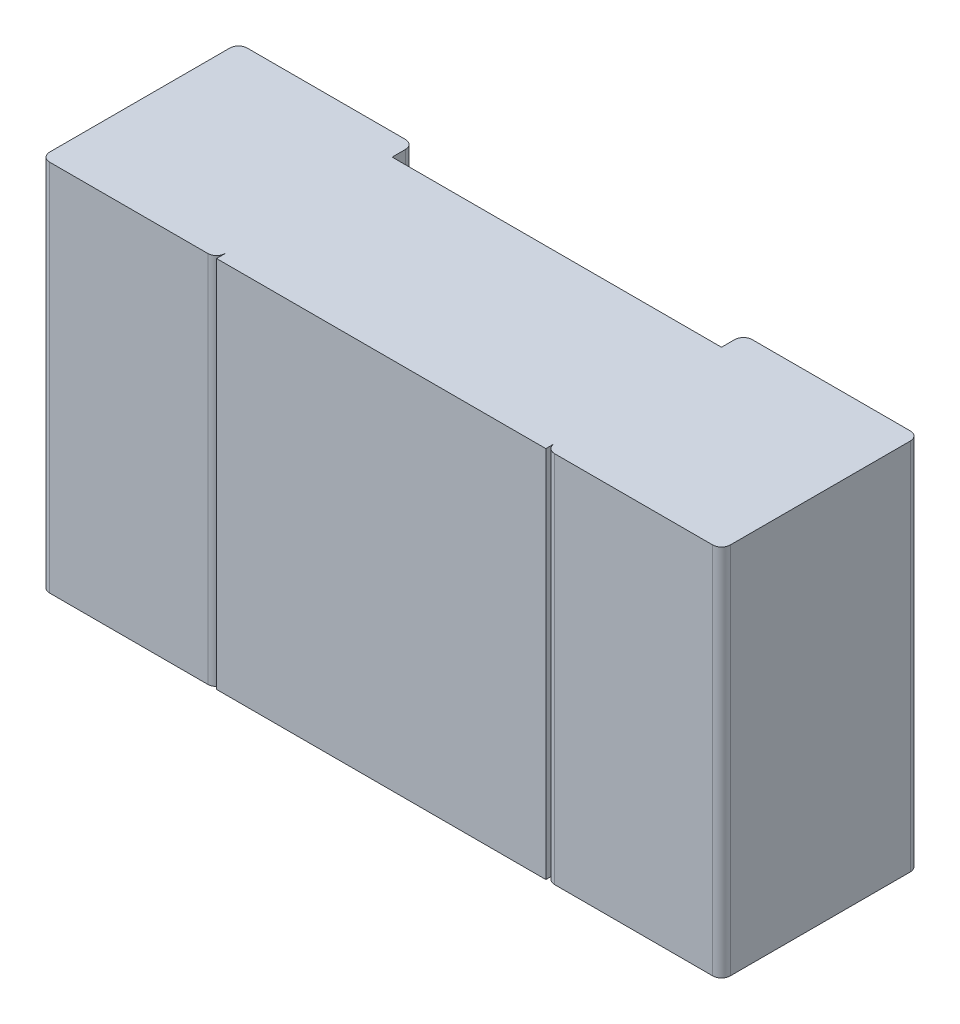
ISO-10303-21;
HEADER;
FILE_DESCRIPTION(('STEP AP214'),'2;1');
FILE_NAME('part.step','',(''),(''),'','','');
FILE_SCHEMA(('AUTOMOTIVE_DESIGN { 1 0 10303 214 1 1 1 1 }'));
ENDSEC;
DATA;
#1=APPLICATION_CONTEXT('core data for automotive mechanical design processes');
#2=APPLICATION_PROTOCOL_DEFINITION('international standard','automotive_design',2000,#1);
#3=PRODUCT_CONTEXT('',#1,'mechanical');
#4=PRODUCT('Part','Part','',(#3));
#5=PRODUCT_RELATED_PRODUCT_CATEGORY('part','',(#4));
#6=PRODUCT_DEFINITION_FORMATION('','',#4);
#7=PRODUCT_DEFINITION_CONTEXT('part definition',#1,'design');
#8=PRODUCT_DEFINITION('design','',#6,#7);
#9=PRODUCT_DEFINITION_SHAPE('','',#8);
#10=(LENGTH_UNIT() NAMED_UNIT(*) SI_UNIT(.MILLI.,.METRE.));
#11=(NAMED_UNIT(*) PLANE_ANGLE_UNIT() SI_UNIT($,.RADIAN.));
#12=(NAMED_UNIT(*) SI_UNIT($,.STERADIAN.) SOLID_ANGLE_UNIT());
#13=UNCERTAINTY_MEASURE_WITH_UNIT(LENGTH_MEASURE(1.E-05),#10,'distance_accuracy_value','');
#14=(GEOMETRIC_REPRESENTATION_CONTEXT(3) GLOBAL_UNCERTAINTY_ASSIGNED_CONTEXT((#13)) GLOBAL_UNIT_ASSIGNED_CONTEXT((#10,
#11,#12)) REPRESENTATION_CONTEXT('',''));
#15=CARTESIAN_POINT('',(0.,0.,0.));
#16=DIRECTION('',(0.,0.,1.));
#17=DIRECTION('',(1.,0.,0.));
#18=AXIS2_PLACEMENT_3D('',#15,#16,#17);
#19=CARTESIAN_POINT('',(-0.775,-0.425,0.));
#20=DIRECTION('',(0.,0.,1.));
#21=DIRECTION('',(1.,0.,0.));
#22=AXIS2_PLACEMENT_3D('',#19,#20,#21);
#23=PLANE('',#22);
#24=DIRECTION('',(1.,0.,0.));
#25=VECTOR('',#24,1.);
#26=CARTESIAN_POINT('',(-0.775,-0.425,0.));
#27=LINE('',#26,#25);
#28=CARTESIAN_POINT('',(-0.395,-0.425,0.));
#29=VERTEX_POINT('',#28);
#30=CARTESIAN_POINT('',(-0.755,-0.425,0.));
#31=VERTEX_POINT('',#30);
#32=EDGE_CURVE('E176',#29,#31,#27,.F.);
#33=ORIENTED_EDGE('',*,*,#32,.T.);
#34=DIRECTION('',(0.,1.,0.));
#35=VECTOR('',#34,1.);
#36=CARTESIAN_POINT('',(-0.755,-0.425,0.));
#37=LINE('',#36,#35);
#38=CARTESIAN_POINT('',(-0.755,0.425,0.));
#39=VERTEX_POINT('',#38);
#40=EDGE_CURVE('E151',#39,#31,#37,.F.);
#41=ORIENTED_EDGE('',*,*,#40,.F.);
#42=DIRECTION('',(1.,0.,0.));
#43=VECTOR('',#42,1.);
#44=CARTESIAN_POINT('',(-0.775,0.425,0.));
#45=LINE('',#44,#43);
#46=CARTESIAN_POINT('',(-0.395,0.425,0.));
#47=VERTEX_POINT('',#46);
#48=EDGE_CURVE('E286',#47,#39,#45,.F.);
#49=ORIENTED_EDGE('',*,*,#48,.F.);
#50=DIRECTION('',(0.,1.,0.));
#51=VECTOR('',#50,1.);
#52=CARTESIAN_POINT('',(-0.395,-0.425,0.));
#53=LINE('',#52,#51);
#54=EDGE_CURVE('E177',#29,#47,#53,.T.);
#55=ORIENTED_EDGE('',*,*,#54,.F.);
#56=EDGE_LOOP('',(#33,#41,#49,#55));
#57=FACE_BOUND('',#56,.T.);
#58=ADVANCED_FACE('F17',(#57),#23,.F.);
#59=CARTESIAN_POINT('',(-0.755,-0.425,0.02));
#60=DIRECTION('',(0.,1.,0.));
#61=DIRECTION('',(0.,0.,1.));
#62=AXIS2_PLACEMENT_3D('',#59,#60,#61);
#63=CYLINDRICAL_SURFACE('',#62,0.02);
#64=ORIENTED_EDGE('',*,*,#40,.T.);
#65=CARTESIAN_POINT('',(-0.755,-0.425,0.02));
#66=DIRECTION('',(0.,1.,0.));
#67=DIRECTION('',(0.,0.,1.));
#68=AXIS2_PLACEMENT_3D('',#65,#66,#67);
#69=CIRCLE('',#68,0.02);
#70=CARTESIAN_POINT('',(-0.775,-0.425,0.02));
#71=VERTEX_POINT('',#70);
#72=EDGE_CURVE('E20',#31,#71,#69,.T.);
#73=ORIENTED_EDGE('',*,*,#72,.T.);
#74=DIRECTION('',(0.,1.,0.));
#75=VECTOR('',#74,1.);
#76=CARTESIAN_POINT('',(-0.775,-0.425,0.02));
#77=LINE('',#76,#75);
#78=CARTESIAN_POINT('',(-0.775,0.425,0.02));
#79=VERTEX_POINT('',#78);
#80=EDGE_CURVE('E158',#71,#79,#77,.T.);
#81=ORIENTED_EDGE('',*,*,#80,.T.);
#82=CARTESIAN_POINT('',(-0.755,0.425,0.02));
#83=DIRECTION('',(0.,1.,0.));
#84=DIRECTION('',(0.,0.,1.));
#85=AXIS2_PLACEMENT_3D('',#82,#83,#84);
#86=CIRCLE('',#85,0.02);
#87=EDGE_CURVE('E284',#39,#79,#86,.T.);
#88=ORIENTED_EDGE('',*,*,#87,.F.);
#89=EDGE_LOOP('',(#64,#73,#81,#88));
#90=FACE_BOUND('',#89,.T.);
#91=ADVANCED_FACE('F175',(#90),#63,.T.);
#92=CARTESIAN_POINT('',(-0.775,-0.425,0.));
#93=DIRECTION('',(1.,0.,0.));
#94=DIRECTION('',(0.,0.,-1.));
#95=AXIS2_PLACEMENT_3D('',#92,#93,#94);
#96=PLANE('',#95);
#97=DIRECTION('',(0.,0.,1.));
#98=VECTOR('',#97,1.);
#99=CARTESIAN_POINT('',(-0.775,0.425,0.));
#100=LINE('',#99,#98);
#101=CARTESIAN_POINT('',(-0.775,0.425,0.43));
#102=VERTEX_POINT('',#101);
#103=EDGE_CURVE('E163',#79,#102,#100,.T.);
#104=ORIENTED_EDGE('',*,*,#103,.F.);
#105=ORIENTED_EDGE('',*,*,#80,.F.);
#106=DIRECTION('',(0.,0.,1.));
#107=VECTOR('',#106,1.);
#108=CARTESIAN_POINT('',(-0.775,-0.425,0.));
#109=LINE('',#108,#107);
#110=CARTESIAN_POINT('',(-0.775,-0.425,0.43));
#111=VERTEX_POINT('',#110);
#112=EDGE_CURVE('E162',#71,#111,#109,.T.);
#113=ORIENTED_EDGE('',*,*,#112,.T.);
#114=DIRECTION('',(0.,1.,0.));
#115=VECTOR('',#114,1.);
#116=CARTESIAN_POINT('',(-0.775,-0.425,0.43));
#117=LINE('',#116,#115);
#118=EDGE_CURVE('E164',#102,#111,#117,.F.);
#119=ORIENTED_EDGE('',*,*,#118,.F.);
#120=EDGE_LOOP('',(#104,#105,#113,#119));
#121=FACE_BOUND('',#120,.T.);
#122=ADVANCED_FACE('F160',(#121),#96,.F.);
#123=CARTESIAN_POINT('',(-0.755,-0.425,0.43));
#124=DIRECTION('',(0.,1.,0.));
#125=DIRECTION('',(0.,0.,1.));
#126=AXIS2_PLACEMENT_3D('',#123,#124,#125);
#127=CYLINDRICAL_SURFACE('',#126,0.02);
#128=CARTESIAN_POINT('',(-0.755,0.425,0.43));
#129=DIRECTION('',(0.,1.,0.));
#130=DIRECTION('',(0.,0.,1.));
#131=AXIS2_PLACEMENT_3D('',#128,#129,#130);
#132=CIRCLE('',#131,0.02);
#133=CARTESIAN_POINT('',(-0.755,0.425,0.45));
#134=VERTEX_POINT('',#133);
#135=EDGE_CURVE('E282',#102,#134,#132,.T.);
#136=ORIENTED_EDGE('',*,*,#135,.F.);
#137=ORIENTED_EDGE('',*,*,#118,.T.);
#138=CARTESIAN_POINT('',(-0.755,-0.425,0.43));
#139=DIRECTION('',(0.,1.,0.));
#140=DIRECTION('',(0.,0.,1.));
#141=AXIS2_PLACEMENT_3D('',#138,#139,#140);
#142=CIRCLE('',#141,0.02);
#143=CARTESIAN_POINT('',(-0.755,-0.425,0.45));
#144=VERTEX_POINT('',#143);
#145=EDGE_CURVE('E173',#111,#144,#142,.T.);
#146=ORIENTED_EDGE('',*,*,#145,.T.);
#147=DIRECTION('',(0.,1.,0.));
#148=VECTOR('',#147,1.);
#149=CARTESIAN_POINT('',(-0.755,-0.425,0.45));
#150=LINE('',#149,#148);
#151=EDGE_CURVE('E246',#134,#144,#150,.F.);
#152=ORIENTED_EDGE('',*,*,#151,.F.);
#153=EDGE_LOOP('',(#136,#137,#146,#152));
#154=FACE_BOUND('',#153,.T.);
#155=ADVANCED_FACE('F378',(#154),#127,.T.);
#156=CARTESIAN_POINT('',(-0.775,-0.425,0.45));
#157=DIRECTION('',(0.,0.,1.));
#158=DIRECTION('',(1.,0.,0.));
#159=AXIS2_PLACEMENT_3D('',#156,#157,#158);
#160=PLANE('',#159);
#161=DIRECTION('',(1.,0.,0.));
#162=VECTOR('',#161,1.);
#163=CARTESIAN_POINT('',(-0.775,-0.425,0.45));
#164=LINE('',#163,#162);
#165=CARTESIAN_POINT('',(-0.395,-0.425,0.45));
#166=VERTEX_POINT('',#165);
#167=EDGE_CURVE('E302',#144,#166,#164,.T.);
#168=ORIENTED_EDGE('',*,*,#167,.T.);
#169=DIRECTION('',(0.,1.,0.));
#170=VECTOR('',#169,1.);
#171=CARTESIAN_POINT('',(-0.395,-0.425,0.45));
#172=LINE('',#171,#170);
#173=CARTESIAN_POINT('',(-0.395,0.425,0.45));
#174=VERTEX_POINT('',#173);
#175=EDGE_CURVE('E243',#174,#166,#172,.F.);
#176=ORIENTED_EDGE('',*,*,#175,.F.);
#177=DIRECTION('',(1.,0.,0.));
#178=VECTOR('',#177,1.);
#179=CARTESIAN_POINT('',(-0.775,0.425,0.45));
#180=LINE('',#179,#178);
#181=EDGE_CURVE('E281',#134,#174,#180,.T.);
#182=ORIENTED_EDGE('',*,*,#181,.F.);
#183=ORIENTED_EDGE('',*,*,#151,.T.);
#184=EDGE_LOOP('',(#168,#176,#182,#183));
#185=FACE_BOUND('',#184,.T.);
#186=ADVANCED_FACE('F380',(#185),#160,.T.);
#187=CARTESIAN_POINT('',(-0.395,-0.425,0.43));
#188=DIRECTION('',(0.,1.,0.));
#189=DIRECTION('',(0.,0.,1.));
#190=AXIS2_PLACEMENT_3D('',#187,#188,#189);
#191=CYLINDRICAL_SURFACE('',#190,0.02);
#192=ORIENTED_EDGE('',*,*,#175,.T.);
#193=CARTESIAN_POINT('',(-0.395,-0.425,0.43));
#194=DIRECTION('',(0.,1.,0.));
#195=DIRECTION('',(0.,0.,1.));
#196=AXIS2_PLACEMENT_3D('',#193,#194,#195);
#197=CIRCLE('',#196,0.02);
#198=CARTESIAN_POINT('',(-0.375,-0.425,0.43));
#199=VERTEX_POINT('',#198);
#200=EDGE_CURVE('E300',#166,#199,#197,.T.);
#201=ORIENTED_EDGE('',*,*,#200,.T.);
#202=DIRECTION('',(0.,1.,0.));
#203=VECTOR('',#202,1.);
#204=CARTESIAN_POINT('',(-0.375,-0.425,0.43));
#205=LINE('',#204,#203);
#206=CARTESIAN_POINT('',(-0.375,0.425,0.43));
#207=VERTEX_POINT('',#206);
#208=EDGE_CURVE('E235',#199,#207,#205,.T.);
#209=ORIENTED_EDGE('',*,*,#208,.T.);
#210=CARTESIAN_POINT('',(-0.395,0.425,0.43));
#211=DIRECTION('',(0.,1.,0.));
#212=DIRECTION('',(0.,0.,1.));
#213=AXIS2_PLACEMENT_3D('',#210,#211,#212);
#214=CIRCLE('',#213,0.02);
#215=EDGE_CURVE('E279',#174,#207,#214,.T.);
#216=ORIENTED_EDGE('',*,*,#215,.F.);
#217=EDGE_LOOP('',(#192,#201,#209,#216));
#218=FACE_BOUND('',#217,.T.);
#219=ADVANCED_FACE('F385',(#218),#191,.T.);
#220=CARTESIAN_POINT('',(-0.375,-0.425,0.4));
#221=DIRECTION('',(1.,0.,0.));
#222=DIRECTION('',(0.,0.,-1.));
#223=AXIS2_PLACEMENT_3D('',#220,#221,#222);
#224=PLANE('',#223);
#225=DIRECTION('',(0.,0.,1.));
#226=VECTOR('',#225,1.);
#227=CARTESIAN_POINT('',(-0.375,0.425,0.4));
#228=LINE('',#227,#226);
#229=CARTESIAN_POINT('',(-0.375,0.425,0.45));
#230=VERTEX_POINT('',#229);
#231=EDGE_CURVE('E231',#207,#230,#228,.T.);
#232=ORIENTED_EDGE('',*,*,#231,.F.);
#233=ORIENTED_EDGE('',*,*,#208,.F.);
#234=DIRECTION('',(0.,0.,1.));
#235=VECTOR('',#234,1.);
#236=CARTESIAN_POINT('',(-0.375,-0.425,0.4));
#237=LINE('',#236,#235);
#238=CARTESIAN_POINT('',(-0.375,-0.425,0.45));
#239=VERTEX_POINT('',#238);
#240=EDGE_CURVE('E259',#199,#239,#237,.T.);
#241=ORIENTED_EDGE('',*,*,#240,.T.);
#242=DIRECTION('',(0.,1.,0.));
#243=VECTOR('',#242,1.);
#244=CARTESIAN_POINT('',(-0.375,-0.425,0.45));
#245=LINE('',#244,#243);
#246=EDGE_CURVE('E227',#230,#239,#245,.F.);
#247=ORIENTED_EDGE('',*,*,#246,.F.);
#248=EDGE_LOOP('',(#232,#233,#241,#247));
#249=FACE_BOUND('',#248,.T.);
#250=ADVANCED_FACE('F388',(#249),#224,.F.);
#251=CARTESIAN_POINT('',(-0.375,-0.425,0.45));
#252=DIRECTION('',(0.,0.,1.));
#253=DIRECTION('',(1.,0.,0.));
#254=AXIS2_PLACEMENT_3D('',#251,#252,#253);
#255=PLANE('',#254);
#256=DIRECTION('',(0.,1.,0.));
#257=VECTOR('',#256,1.);
#258=CARTESIAN_POINT('',(0.375,-0.425,0.45));
#259=LINE('',#258,#257);
#260=CARTESIAN_POINT('',(0.375,0.425,0.45));
#261=VERTEX_POINT('',#260);
#262=CARTESIAN_POINT('',(0.375,-0.425,0.45));
#263=VERTEX_POINT('',#262);
#264=EDGE_CURVE('E215',#261,#263,#259,.F.);
#265=ORIENTED_EDGE('',*,*,#264,.F.);
#266=DIRECTION('',(1.,0.,0.));
#267=VECTOR('',#266,1.);
#268=CARTESIAN_POINT('',(-0.375,0.425,0.45));
#269=LINE('',#268,#267);
#270=EDGE_CURVE('E219',#230,#261,#269,.T.);
#271=ORIENTED_EDGE('',*,*,#270,.F.);
#272=ORIENTED_EDGE('',*,*,#246,.T.);
#273=DIRECTION('',(1.,0.,0.));
#274=VECTOR('',#273,1.);
#275=CARTESIAN_POINT('',(-0.375,-0.425,0.45));
#276=LINE('',#275,#274);
#277=EDGE_CURVE('E254',#239,#263,#276,.T.);
#278=ORIENTED_EDGE('',*,*,#277,.T.);
#279=EDGE_LOOP('',(#265,#271,#272,#278));
#280=FACE_BOUND('',#279,.T.);
#281=ADVANCED_FACE('F393',(#280),#255,.T.);
#282=CARTESIAN_POINT('',(0.375,-0.425,0.4));
#283=DIRECTION('',(1.,0.,0.));
#284=DIRECTION('',(0.,0.,-1.));
#285=AXIS2_PLACEMENT_3D('',#282,#283,#284);
#286=PLANE('',#285);
#287=DIRECTION('',(0.,0.,1.));
#288=VECTOR('',#287,1.);
#289=CARTESIAN_POINT('',(0.375,0.425,0.4));
#290=LINE('',#289,#288);
#291=CARTESIAN_POINT('',(0.375,0.425,0.43));
#292=VERTEX_POINT('',#291);
#293=EDGE_CURVE('E216',#261,#292,#290,.F.);
#294=ORIENTED_EDGE('',*,*,#293,.F.);
#295=ORIENTED_EDGE('',*,*,#264,.T.);
#296=DIRECTION('',(0.,0.,1.));
#297=VECTOR('',#296,1.);
#298=CARTESIAN_POINT('',(0.375,-0.425,0.4));
#299=LINE('',#298,#297);
#300=CARTESIAN_POINT('',(0.375,-0.425,0.43));
#301=VERTEX_POINT('',#300);
#302=EDGE_CURVE('E250',#263,#301,#299,.F.);
#303=ORIENTED_EDGE('',*,*,#302,.T.);
#304=DIRECTION('',(0.,1.,0.));
#305=VECTOR('',#304,1.);
#306=CARTESIAN_POINT('',(0.375,-0.425,0.43));
#307=LINE('',#306,#305);
#308=EDGE_CURVE('E213',#292,#301,#307,.F.);
#309=ORIENTED_EDGE('',*,*,#308,.F.);
#310=EDGE_LOOP('',(#294,#295,#303,#309));
#311=FACE_BOUND('',#310,.T.);
#312=ADVANCED_FACE('F399',(#311),#286,.T.);
#313=CARTESIAN_POINT('',(0.375,-0.425,0.));
#314=DIRECTION('',(0.,0.,1.));
#315=DIRECTION('',(1.,0.,0.));
#316=AXIS2_PLACEMENT_3D('',#313,#314,#315);
#317=PLANE('',#316);
#318=DIRECTION('',(1.,0.,0.));
#319=VECTOR('',#318,1.);
#320=CARTESIAN_POINT('',(0.375,-0.425,0.));
#321=LINE('',#320,#319);
#322=CARTESIAN_POINT('',(0.755,-0.425,0.));
#323=VERTEX_POINT('',#322);
#324=CARTESIAN_POINT('',(0.395,-0.425,0.));
#325=VERTEX_POINT('',#324);
#326=EDGE_CURVE('E253',#323,#325,#321,.F.);
#327=ORIENTED_EDGE('',*,*,#326,.T.);
#328=DIRECTION('',(0.,1.,0.));
#329=VECTOR('',#328,1.);
#330=CARTESIAN_POINT('',(0.395,-0.425,0.));
#331=LINE('',#330,#329);
#332=CARTESIAN_POINT('',(0.395,0.425,0.));
#333=VERTEX_POINT('',#332);
#334=EDGE_CURVE('E222',#333,#325,#331,.F.);
#335=ORIENTED_EDGE('',*,*,#334,.F.);
#336=DIRECTION('',(1.,0.,0.));
#337=VECTOR('',#336,1.);
#338=CARTESIAN_POINT('',(0.375,0.425,0.));
#339=LINE('',#338,#337);
#340=CARTESIAN_POINT('',(0.755,0.425,0.));
#341=VERTEX_POINT('',#340);
#342=EDGE_CURVE('E218',#341,#333,#339,.F.);
#343=ORIENTED_EDGE('',*,*,#342,.F.);
#344=DIRECTION('',(0.,1.,0.));
#345=VECTOR('',#344,1.);
#346=CARTESIAN_POINT('',(0.755,-0.425,0.));
#347=LINE('',#346,#345);
#348=EDGE_CURVE('E204',#323,#341,#347,.T.);
#349=ORIENTED_EDGE('',*,*,#348,.F.);
#350=EDGE_LOOP('',(#327,#335,#343,#349));
#351=FACE_BOUND('',#350,.T.);
#352=ADVANCED_FACE('F355',(#351),#317,.F.);
#353=CARTESIAN_POINT('',(0.395,-0.425,0.43));
#354=DIRECTION('',(0.,1.,0.));
#355=DIRECTION('',(0.,0.,1.));
#356=AXIS2_PLACEMENT_3D('',#353,#354,#355);
#357=CYLINDRICAL_SURFACE('',#356,0.02);
#358=CARTESIAN_POINT('',(0.395,0.425,0.43));
#359=DIRECTION('',(0.,1.,0.));
#360=DIRECTION('',(0.,0.,1.));
#361=AXIS2_PLACEMENT_3D('',#358,#359,#360);
#362=CIRCLE('',#361,0.02);
#363=CARTESIAN_POINT('',(0.395,0.425,0.45));
#364=VERTEX_POINT('',#363);
#365=EDGE_CURVE('E273',#292,#364,#362,.T.);
#366=ORIENTED_EDGE('',*,*,#365,.F.);
#367=ORIENTED_EDGE('',*,*,#308,.T.);
#368=CARTESIAN_POINT('',(0.395,-0.425,0.43));
#369=DIRECTION('',(0.,1.,0.));
#370=DIRECTION('',(0.,0.,1.));
#371=AXIS2_PLACEMENT_3D('',#368,#369,#370);
#372=CIRCLE('',#371,0.02);
#373=CARTESIAN_POINT('',(0.395,-0.425,0.45));
#374=VERTEX_POINT('',#373);
#375=EDGE_CURVE('E295',#301,#374,#372,.T.);
#376=ORIENTED_EDGE('',*,*,#375,.T.);
#377=DIRECTION('',(0.,1.,0.));
#378=VECTOR('',#377,1.);
#379=CARTESIAN_POINT('',(0.395,-0.425,0.45));
#380=LINE('',#379,#378);
#381=EDGE_CURVE('E211',#364,#374,#380,.F.);
#382=ORIENTED_EDGE('',*,*,#381,.F.);
#383=EDGE_LOOP('',(#366,#367,#376,#382));
#384=FACE_BOUND('',#383,.T.);
#385=ADVANCED_FACE('F403',(#384),#357,.T.);
#386=CARTESIAN_POINT('',(0.375,-0.425,0.45));
#387=DIRECTION('',(0.,0.,1.));
#388=DIRECTION('',(1.,0.,0.));
#389=AXIS2_PLACEMENT_3D('',#386,#387,#388);
#390=PLANE('',#389);
#391=DIRECTION('',(1.,0.,0.));
#392=VECTOR('',#391,1.);
#393=CARTESIAN_POINT('',(0.375,-0.425,0.45));
#394=LINE('',#393,#392);
#395=CARTESIAN_POINT('',(0.755,-0.425,0.45));
#396=VERTEX_POINT('',#395);
#397=EDGE_CURVE('E294',#374,#396,#394,.T.);
#398=ORIENTED_EDGE('',*,*,#397,.T.);
#399=DIRECTION('',(0.,1.,0.));
#400=VECTOR('',#399,1.);
#401=CARTESIAN_POINT('',(0.755,-0.425,0.45));
#402=LINE('',#401,#400);
#403=CARTESIAN_POINT('',(0.755,0.425,0.45));
#404=VERTEX_POINT('',#403);
#405=EDGE_CURVE('E209',#404,#396,#402,.F.);
#406=ORIENTED_EDGE('',*,*,#405,.F.);
#407=DIRECTION('',(1.,0.,0.));
#408=VECTOR('',#407,1.);
#409=CARTESIAN_POINT('',(0.375,0.425,0.45));
#410=LINE('',#409,#408);
#411=EDGE_CURVE('E272',#364,#404,#410,.T.);
#412=ORIENTED_EDGE('',*,*,#411,.F.);
#413=ORIENTED_EDGE('',*,*,#381,.T.);
#414=EDGE_LOOP('',(#398,#406,#412,#413));
#415=FACE_BOUND('',#414,.T.);
#416=ADVANCED_FACE('F408',(#415),#390,.T.);
#417=CARTESIAN_POINT('',(0.755,-0.425,0.43));
#418=DIRECTION('',(0.,1.,0.));
#419=DIRECTION('',(0.,0.,1.));
#420=AXIS2_PLACEMENT_3D('',#417,#418,#419);
#421=CYLINDRICAL_SURFACE('',#420,0.02);
#422=ORIENTED_EDGE('',*,*,#405,.T.);
#423=CARTESIAN_POINT('',(0.755,-0.425,0.43));
#424=DIRECTION('',(0.,1.,0.));
#425=DIRECTION('',(0.,0.,1.));
#426=AXIS2_PLACEMENT_3D('',#423,#424,#425);
#427=CIRCLE('',#426,0.02);
#428=CARTESIAN_POINT('',(0.775,-0.425,0.43));
#429=VERTEX_POINT('',#428);
#430=EDGE_CURVE('E291',#396,#429,#427,.T.);
#431=ORIENTED_EDGE('',*,*,#430,.T.);
#432=DIRECTION('',(0.,1.,0.));
#433=VECTOR('',#432,1.);
#434=CARTESIAN_POINT('',(0.775,-0.425,0.43));
#435=LINE('',#434,#433);
#436=CARTESIAN_POINT('',(0.775,0.425,0.43));
#437=VERTEX_POINT('',#436);
#438=EDGE_CURVE('E206',#437,#429,#435,.F.);
#439=ORIENTED_EDGE('',*,*,#438,.F.);
#440=CARTESIAN_POINT('',(0.755,0.425,0.43));
#441=DIRECTION('',(0.,1.,0.));
#442=DIRECTION('',(0.,0.,1.));
#443=AXIS2_PLACEMENT_3D('',#440,#441,#442);
#444=CIRCLE('',#443,0.02);
#445=EDGE_CURVE('E270',#404,#437,#444,.T.);
#446=ORIENTED_EDGE('',*,*,#445,.F.);
#447=EDGE_LOOP('',(#422,#431,#439,#446));
#448=FACE_BOUND('',#447,.T.);
#449=ADVANCED_FACE('F411',(#448),#421,.T.);
#450=CARTESIAN_POINT('',(0.775,-0.425,0.));
#451=DIRECTION('',(1.,0.,0.));
#452=DIRECTION('',(0.,0.,-1.));
#453=AXIS2_PLACEMENT_3D('',#450,#451,#452);
#454=PLANE('',#453);
#455=DIRECTION('',(0.,0.,1.));
#456=VECTOR('',#455,1.);
#457=CARTESIAN_POINT('',(0.775,0.425,0.));
#458=LINE('',#457,#456);
#459=CARTESIAN_POINT('',(0.775,0.425,0.02));
#460=VERTEX_POINT('',#459);
#461=EDGE_CURVE('E269',#437,#460,#458,.F.);
#462=ORIENTED_EDGE('',*,*,#461,.F.);
#463=ORIENTED_EDGE('',*,*,#438,.T.);
#464=DIRECTION('',(0.,0.,1.));
#465=VECTOR('',#464,1.);
#466=CARTESIAN_POINT('',(0.775,-0.425,0.));
#467=LINE('',#466,#465);
#468=CARTESIAN_POINT('',(0.775,-0.425,0.02));
#469=VERTEX_POINT('',#468);
#470=EDGE_CURVE('E290',#429,#469,#467,.F.);
#471=ORIENTED_EDGE('',*,*,#470,.T.);
#472=DIRECTION('',(0.,1.,0.));
#473=VECTOR('',#472,1.);
#474=CARTESIAN_POINT('',(0.775,-0.425,0.02));
#475=LINE('',#474,#473);
#476=EDGE_CURVE('E181',#460,#469,#475,.F.);
#477=ORIENTED_EDGE('',*,*,#476,.F.);
#478=EDGE_LOOP('',(#462,#463,#471,#477));
#479=FACE_BOUND('',#478,.T.);
#480=ADVANCED_FACE('F348',(#479),#454,.T.);
#481=CARTESIAN_POINT('',(0.755,-0.425,0.02));
#482=DIRECTION('',(0.,1.,0.));
#483=DIRECTION('',(0.,0.,1.));
#484=AXIS2_PLACEMENT_3D('',#481,#482,#483);
#485=CYLINDRICAL_SURFACE('',#484,0.02);
#486=CARTESIAN_POINT('',(0.755,0.425,0.02));
#487=DIRECTION('',(0.,1.,0.));
#488=DIRECTION('',(0.,0.,1.));
#489=AXIS2_PLACEMENT_3D('',#486,#487,#488);
#490=CIRCLE('',#489,0.02);
#491=EDGE_CURVE('E189',#460,#341,#490,.T.);
#492=ORIENTED_EDGE('',*,*,#491,.F.);
#493=ORIENTED_EDGE('',*,*,#476,.T.);
#494=CARTESIAN_POINT('',(0.755,-0.425,0.02));
#495=DIRECTION('',(0.,1.,0.));
#496=DIRECTION('',(0.,0.,1.));
#497=AXIS2_PLACEMENT_3D('',#494,#495,#496);
#498=CIRCLE('',#497,0.02);
#499=EDGE_CURVE('E225',#469,#323,#498,.T.);
#500=ORIENTED_EDGE('',*,*,#499,.T.);
#501=ORIENTED_EDGE('',*,*,#348,.T.);
#502=EDGE_LOOP('',(#492,#493,#500,#501));
#503=FACE_BOUND('',#502,.T.);
#504=ADVANCED_FACE('F352',(#503),#485,.T.);
#505=CARTESIAN_POINT('',(-0.395,-0.425,0.02));
#506=DIRECTION('',(0.,1.,0.));
#507=DIRECTION('',(0.,0.,1.));
#508=AXIS2_PLACEMENT_3D('',#505,#506,#507);
#509=CYLINDRICAL_SURFACE('',#508,0.02);
#510=CARTESIAN_POINT('',(-0.395,0.425,0.02));
#511=DIRECTION('',(0.,1.,0.));
#512=DIRECTION('',(0.,0.,1.));
#513=AXIS2_PLACEMENT_3D('',#510,#511,#512);
#514=CIRCLE('',#513,0.02);
#515=CARTESIAN_POINT('',(-0.375,0.425,0.02));
#516=VERTEX_POINT('',#515);
#517=EDGE_CURVE('E239',#516,#47,#514,.T.);
#518=ORIENTED_EDGE('',*,*,#517,.F.);
#519=DIRECTION('',(0.,1.,0.));
#520=VECTOR('',#519,1.);
#521=CARTESIAN_POINT('',(-0.375,-0.425,0.02));
#522=LINE('',#521,#520);
#523=CARTESIAN_POINT('',(-0.375,-0.425,0.02));
#524=VERTEX_POINT('',#523);
#525=EDGE_CURVE('E188',#524,#516,#522,.T.);
#526=ORIENTED_EDGE('',*,*,#525,.F.);
#527=CARTESIAN_POINT('',(-0.395,-0.425,0.02));
#528=DIRECTION('',(0.,1.,0.));
#529=DIRECTION('',(0.,0.,1.));
#530=AXIS2_PLACEMENT_3D('',#527,#528,#529);
#531=CIRCLE('',#530,0.02);
#532=EDGE_CURVE('E264',#524,#29,#531,.T.);
#533=ORIENTED_EDGE('',*,*,#532,.T.);
#534=ORIENTED_EDGE('',*,*,#54,.T.);
#535=EDGE_LOOP('',(#518,#526,#533,#534));
#536=FACE_BOUND('',#535,.T.);
#537=ADVANCED_FACE('F376',(#536),#509,.T.);
#538=CARTESIAN_POINT('',(0.395,-0.425,0.02));
#539=DIRECTION('',(0.,1.,0.));
#540=DIRECTION('',(0.,0.,1.));
#541=AXIS2_PLACEMENT_3D('',#538,#539,#540);
#542=CYLINDRICAL_SURFACE('',#541,0.02);
#543=ORIENTED_EDGE('',*,*,#334,.T.);
#544=CARTESIAN_POINT('',(0.395,-0.425,0.02));
#545=DIRECTION('',(0.,1.,0.));
#546=DIRECTION('',(0.,0.,1.));
#547=AXIS2_PLACEMENT_3D('',#544,#545,#546);
#548=CIRCLE('',#547,0.02);
#549=CARTESIAN_POINT('',(0.375,-0.425,0.02));
#550=VERTEX_POINT('',#549);
#551=EDGE_CURVE('E224',#325,#550,#548,.T.);
#552=ORIENTED_EDGE('',*,*,#551,.T.);
#553=DIRECTION('',(0.,1.,0.));
#554=VECTOR('',#553,1.);
#555=CARTESIAN_POINT('',(0.375,-0.425,0.02));
#556=LINE('',#555,#554);
#557=CARTESIAN_POINT('',(0.375,0.425,0.02));
#558=VERTEX_POINT('',#557);
#559=EDGE_CURVE('E323',#550,#558,#556,.T.);
#560=ORIENTED_EDGE('',*,*,#559,.T.);
#561=CARTESIAN_POINT('',(0.395,0.425,0.02));
#562=DIRECTION('',(0.,1.,0.));
#563=DIRECTION('',(0.,0.,1.));
#564=AXIS2_PLACEMENT_3D('',#561,#562,#563);
#565=CIRCLE('',#564,0.02);
#566=EDGE_CURVE('E275',#333,#558,#565,.T.);
#567=ORIENTED_EDGE('',*,*,#566,.F.);
#568=EDGE_LOOP('',(#543,#552,#560,#567));
#569=FACE_BOUND('',#568,.T.);
#570=ADVANCED_FACE('F364',(#569),#542,.T.);
#571=CARTESIAN_POINT('',(-0.375,-0.425,0.));
#572=DIRECTION('',(1.,0.,0.));
#573=DIRECTION('',(0.,0.,-1.));
#574=AXIS2_PLACEMENT_3D('',#571,#572,#573);
#575=PLANE('',#574);
#576=DIRECTION('',(0.,0.,-1.));
#577=VECTOR('',#576,1.);
#578=CARTESIAN_POINT('',(-0.375,0.425,0.));
#579=LINE('',#578,#577);
#580=CARTESIAN_POINT('',(-0.375,0.425,0.05));
#581=VERTEX_POINT('',#580);
#582=EDGE_CURVE('E199',#516,#581,#579,.F.);
#583=ORIENTED_EDGE('',*,*,#582,.T.);
#584=DIRECTION('',(0.,1.,0.));
#585=VECTOR('',#584,1.);
#586=CARTESIAN_POINT('',(-0.375,-0.425,0.05));
#587=LINE('',#586,#585);
#588=CARTESIAN_POINT('',(-0.375,-0.425,0.05));
#589=VERTEX_POINT('',#588);
#590=EDGE_CURVE('E192',#581,#589,#587,.F.);
#591=ORIENTED_EDGE('',*,*,#590,.T.);
#592=DIRECTION('',(0.,0.,-1.));
#593=VECTOR('',#592,1.);
#594=CARTESIAN_POINT('',(-0.375,-0.425,0.));
#595=LINE('',#594,#593);
#596=EDGE_CURVE('E185',#589,#524,#595,.T.);
#597=ORIENTED_EDGE('',*,*,#596,.T.);
#598=ORIENTED_EDGE('',*,*,#525,.T.);
#599=EDGE_LOOP('',(#583,#591,#597,#598));
#600=FACE_BOUND('',#599,.T.);
#601=ADVANCED_FACE('F373',(#600),#575,.T.);
#602=CARTESIAN_POINT('',(-0.725,-0.425,0.05));
#603=DIRECTION('',(0.,1.,0.));
#604=DIRECTION('',(0.,0.,1.));
#605=AXIS2_PLACEMENT_3D('',#602,#603,#604);
#606=PLANE('',#605);
#607=ORIENTED_EDGE('',*,*,#240,.F.);
#608=ORIENTED_EDGE('',*,*,#200,.F.);
#609=ORIENTED_EDGE('',*,*,#167,.F.);
#610=ORIENTED_EDGE('',*,*,#145,.F.);
#611=ORIENTED_EDGE('',*,*,#112,.F.);
#612=ORIENTED_EDGE('',*,*,#72,.F.);
#613=ORIENTED_EDGE('',*,*,#32,.F.);
#614=ORIENTED_EDGE('',*,*,#532,.F.);
#615=ORIENTED_EDGE('',*,*,#596,.F.);
#616=DIRECTION('',(1.,0.,0.));
#617=VECTOR('',#616,1.);
#618=CARTESIAN_POINT('',(-0.725,-0.425,0.05));
#619=LINE('',#618,#617);
#620=CARTESIAN_POINT('',(0.375,-0.425,0.05));
#621=VERTEX_POINT('',#620);
#622=EDGE_CURVE('E195',#589,#621,#619,.T.);
#623=ORIENTED_EDGE('',*,*,#622,.T.);
#624=DIRECTION('',(0.,0.,-1.));
#625=VECTOR('',#624,1.);
#626=CARTESIAN_POINT('',(0.375,-0.425,0.));
#627=LINE('',#626,#625);
#628=EDGE_CURVE('E201',#621,#550,#627,.T.);
#629=ORIENTED_EDGE('',*,*,#628,.T.);
#630=ORIENTED_EDGE('',*,*,#551,.F.);
#631=ORIENTED_EDGE('',*,*,#326,.F.);
#632=ORIENTED_EDGE('',*,*,#499,.F.);
#633=ORIENTED_EDGE('',*,*,#470,.F.);
#634=ORIENTED_EDGE('',*,*,#430,.F.);
#635=ORIENTED_EDGE('',*,*,#397,.F.);
#636=ORIENTED_EDGE('',*,*,#375,.F.);
#637=ORIENTED_EDGE('',*,*,#302,.F.);
#638=ORIENTED_EDGE('',*,*,#277,.F.);
#639=EDGE_LOOP('',(#607,#608,#609,#610,#611,#612,#613,#614,#615,#623,#629,#630,#631,#632,#633,
#634,#635,#636,#637,#638));
#640=FACE_BOUND('',#639,.T.);
#641=ADVANCED_FACE('F169',(#640),#606,.F.);
#642=CARTESIAN_POINT('',(0.375,-0.425,0.));
#643=DIRECTION('',(1.,0.,0.));
#644=DIRECTION('',(0.,0.,-1.));
#645=AXIS2_PLACEMENT_3D('',#642,#643,#644);
#646=PLANE('',#645);
#647=DIRECTION('',(0.,0.,-1.));
#648=VECTOR('',#647,1.);
#649=CARTESIAN_POINT('',(0.375,0.425,0.));
#650=LINE('',#649,#648);
#651=CARTESIAN_POINT('',(0.375,0.425,0.05));
#652=VERTEX_POINT('',#651);
#653=EDGE_CURVE('E34',#558,#652,#650,.F.);
#654=ORIENTED_EDGE('',*,*,#653,.F.);
#655=ORIENTED_EDGE('',*,*,#559,.F.);
#656=ORIENTED_EDGE('',*,*,#628,.F.);
#657=DIRECTION('',(0.,1.,0.));
#658=VECTOR('',#657,1.);
#659=CARTESIAN_POINT('',(0.375,-0.425,0.05));
#660=LINE('',#659,#658);
#661=EDGE_CURVE('E26',#621,#652,#660,.T.);
#662=ORIENTED_EDGE('',*,*,#661,.T.);
#663=EDGE_LOOP('',(#654,#655,#656,#662));
#664=FACE_BOUND('',#663,.T.);
#665=ADVANCED_FACE('F362',(#664),#646,.F.);
#666=CARTESIAN_POINT('',(-0.725,0.425,0.05));
#667=DIRECTION('',(0.,1.,0.));
#668=DIRECTION('',(0.,0.,1.));
#669=AXIS2_PLACEMENT_3D('',#666,#667,#668);
#670=PLANE('',#669);
#671=ORIENTED_EDGE('',*,*,#215,.T.);
#672=ORIENTED_EDGE('',*,*,#231,.T.);
#673=ORIENTED_EDGE('',*,*,#270,.T.);
#674=ORIENTED_EDGE('',*,*,#293,.T.);
#675=ORIENTED_EDGE('',*,*,#365,.T.);
#676=ORIENTED_EDGE('',*,*,#411,.T.);
#677=ORIENTED_EDGE('',*,*,#445,.T.);
#678=ORIENTED_EDGE('',*,*,#461,.T.);
#679=ORIENTED_EDGE('',*,*,#491,.T.);
#680=ORIENTED_EDGE('',*,*,#342,.T.);
#681=ORIENTED_EDGE('',*,*,#566,.T.);
#682=ORIENTED_EDGE('',*,*,#653,.T.);
#683=DIRECTION('',(1.,0.,0.));
#684=VECTOR('',#683,1.);
#685=CARTESIAN_POINT('',(-0.725,0.425,0.05));
#686=LINE('',#685,#684);
#687=EDGE_CURVE('E11',#652,#581,#686,.F.);
#688=ORIENTED_EDGE('',*,*,#687,.T.);
#689=ORIENTED_EDGE('',*,*,#582,.F.);
#690=ORIENTED_EDGE('',*,*,#517,.T.);
#691=ORIENTED_EDGE('',*,*,#48,.T.);
#692=ORIENTED_EDGE('',*,*,#87,.T.);
#693=ORIENTED_EDGE('',*,*,#103,.T.);
#694=ORIENTED_EDGE('',*,*,#135,.T.);
#695=ORIENTED_EDGE('',*,*,#181,.T.);
#696=EDGE_LOOP('',(#671,#672,#673,#674,#675,#676,#677,#678,#679,#680,#681,#682,#688,#689,#690,
#691,#692,#693,#694,#695));
#697=FACE_BOUND('',#696,.T.);
#698=ADVANCED_FACE('F342',(#697),#670,.T.);
#699=CARTESIAN_POINT('',(-0.725,-0.425,0.05));
#700=DIRECTION('',(0.,0.,1.));
#701=DIRECTION('',(1.,0.,0.));
#702=AXIS2_PLACEMENT_3D('',#699,#700,#701);
#703=PLANE('',#702);
#704=ORIENTED_EDGE('',*,*,#661,.F.);
#705=ORIENTED_EDGE('',*,*,#622,.F.);
#706=ORIENTED_EDGE('',*,*,#590,.F.);
#707=ORIENTED_EDGE('',*,*,#687,.F.);
#708=EDGE_LOOP('',(#704,#705,#706,#707));
#709=FACE_BOUND('',#708,.T.);
#710=ADVANCED_FACE('F367',(#709),#703,.F.);
#711=CLOSED_SHELL('',(#58,#91,#122,#155,#186,#219,#250,#281,#312,#352,#385,#416,#449,#480,#504,
#537,#570,#601,#641,#665,#698,#710));
#712=MANIFOLD_SOLID_BREP('B1',#711);
#713=ADVANCED_BREP_SHAPE_REPRESENTATION('',(#18,#712),#14);
#714=SHAPE_DEFINITION_REPRESENTATION(#9,#713);
ENDSEC;
END-ISO-10303-21;
